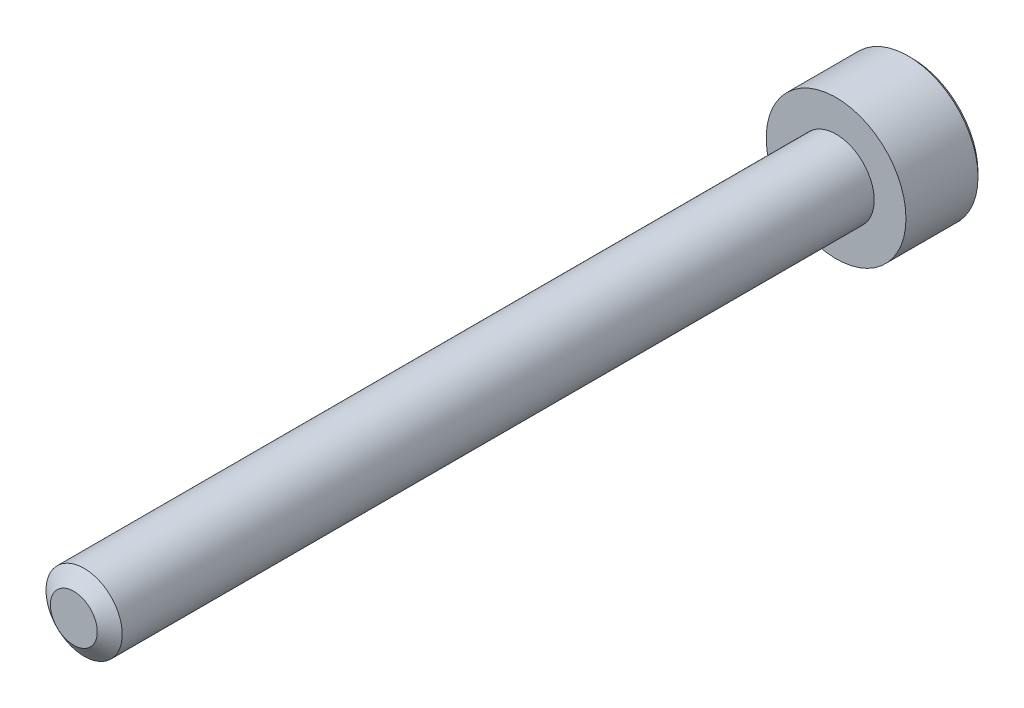
ISO-10303-21;
HEADER;
FILE_DESCRIPTION(('STEP AP214'),'2;1');
FILE_NAME('part.step','',(''),(''),'','','');
FILE_SCHEMA(('AUTOMOTIVE_DESIGN { 1 0 10303 214 1 1 1 1 }'));
ENDSEC;
DATA;
#1=APPLICATION_CONTEXT('core data for automotive mechanical design processes');
#2=APPLICATION_PROTOCOL_DEFINITION('international standard','automotive_design',2000,#1);
#3=PRODUCT_CONTEXT('',#1,'mechanical');
#4=PRODUCT('Part','Part','',(#3));
#5=PRODUCT_RELATED_PRODUCT_CATEGORY('part','',(#4));
#6=PRODUCT_DEFINITION_FORMATION('','',#4);
#7=PRODUCT_DEFINITION_CONTEXT('part definition',#1,'design');
#8=PRODUCT_DEFINITION('design','',#6,#7);
#9=PRODUCT_DEFINITION_SHAPE('','',#8);
#10=(LENGTH_UNIT() NAMED_UNIT(*) SI_UNIT(.MILLI.,.METRE.));
#11=(NAMED_UNIT(*) PLANE_ANGLE_UNIT() SI_UNIT($,.RADIAN.));
#12=(NAMED_UNIT(*) SI_UNIT($,.STERADIAN.) SOLID_ANGLE_UNIT());
#13=UNCERTAINTY_MEASURE_WITH_UNIT(LENGTH_MEASURE(1.E-05),#10,'distance_accuracy_value','');
#14=(GEOMETRIC_REPRESENTATION_CONTEXT(3) GLOBAL_UNCERTAINTY_ASSIGNED_CONTEXT((#13)) GLOBAL_UNIT_ASSIGNED_CONTEXT((#10,
#11,#12)) REPRESENTATION_CONTEXT('',''));
#15=CARTESIAN_POINT('',(0.,0.,0.));
#16=DIRECTION('',(0.,0.,1.));
#17=DIRECTION('',(1.,0.,0.));
#18=AXIS2_PLACEMENT_3D('',#15,#16,#17);
#19=CARTESIAN_POINT('',(0.,-1.44337567297406,-31.125));
#20=DIRECTION('',(-0.5,-0.866025403784439,0.));
#21=DIRECTION('',(0.866025403784439,-0.5,0.));
#22=AXIS2_PLACEMENT_3D('',#19,#20,#21);
#23=PLANE('',#22);
#24=CARTESIAN_POINT('',(-1.24999999999719,-0.721687836488653,-33.0000000000106));
#25=CARTESIAN_POINT('',(-1.20703689149334,-0.746492598748569,-32.9752190397288));
#26=CARTESIAN_POINT('',(-1.16335543595188,-0.771712098864028,-32.9518937494737));
#27=CARTESIAN_POINT('',(-1.07428446543455,-0.823137247669188,-32.9091861389212));
#28=CARTESIAN_POINT('',(-1.02888648443341,-0.849347784220863,-32.8898275733605));
#29=CARTESIAN_POINT('',(-0.937343688520915,-0.902200042083313,-32.8566662159147));
#30=CARTESIAN_POINT('',(-0.891222174140705,-0.928828310826161,-32.8427800967852));
#31=CARTESIAN_POINT('',(-0.79796403889092,-0.982670920316747,-32.8213859018018));
#32=CARTESIAN_POINT('',(-0.750830264933392,-1.00988361739905,-32.8138618619237));
#33=CARTESIAN_POINT('',(-0.669590913521733,-1.05678717880536,-32.8070728277984));
#34=CARTESIAN_POINT('',(-0.635590177984294,-1.07641751262055,-32.8060681886569));
#35=CARTESIAN_POINT('',(-0.567648554675317,-1.11564362712716,-32.8077634952234));
#36=CARTESIAN_POINT('',(-0.533707681782074,-1.13523939922861,-32.8104642592638));
#37=CARTESIAN_POINT('',(-0.466153619735585,-1.174241755136,-32.8194142483472));
#38=CARTESIAN_POINT('',(-0.432540764897262,-1.19364814592514,-32.8256667730595));
#39=CARTESIAN_POINT('',(-0.365876260757552,-1.23213691533559,-32.8413835392478));
#40=CARTESIAN_POINT('',(-0.332824858668373,-1.25121915122888,-32.8508491588607));
#41=CARTESIAN_POINT('',(-0.248213569936039,-1.30006950155497,-32.8789283315822));
#42=CARTESIAN_POINT('',(-0.197186124432403,-1.32953021095255,-32.8996493450655));
#43=CARTESIAN_POINT('',(-0.0971276056231052,-1.38729902372182,-32.9463235058209));
#44=CARTESIAN_POINT('',(-0.0480906425397016,-1.41561052755826,-32.9722596212326));
#45=CARTESIAN_POINT('',(-2.80957824535407E-12,-1.44337567297244,-33.0000000000106));
#46=B_SPLINE_CURVE_WITH_KNOTS('',3,(#24,#25,#26,#27,#28,#29,#30,#31,#32,#33,#34,#35,#36,#37,#38,
#39,#40,#41,#42,#43,#44,#45),.UNSPECIFIED.,.F.,.F.,(4,2,2,2,2,2,2,2,2,2,4),(0.,
0.166478683225078,0.333926926831281,0.498716658516144,0.663091654625516,0.780745575557468,
0.898425484350478,1.01621489976922,1.13405490052337,1.32111591641063,1.50757565757894),.UNSPECIFIED.);
#47=CARTESIAN_POINT('',(-1.25000000000136,-0.721687836486245,-33.0000000000131));
#48=VERTEX_POINT('',#47);
#49=CARTESIAN_POINT('',(-4.16671953249464E-12,-1.44337567297485,-33.0000000000131));
#50=VERTEX_POINT('',#49);
#51=EDGE_CURVE('E21',#48,#50,#46,.T.);
#52=ORIENTED_EDGE('',*,*,#51,.F.);
#53=DIRECTION('',(0.,0.,1.));
#54=VECTOR('',#53,1.);
#55=CARTESIAN_POINT('',(-1.25,-0.721687836487032,-31.125));
#56=LINE('',#55,#54);
#57=CARTESIAN_POINT('',(-1.25,-0.721687836487031,-31.125));
#58=VERTEX_POINT('',#57);
#59=EDGE_CURVE('E104',#48,#58,#56,.T.);
#60=ORIENTED_EDGE('',*,*,#59,.T.);
#61=DIRECTION('',(0.866025403784439,-0.5,0.));
#62=VECTOR('',#61,1.);
#63=CARTESIAN_POINT('',(0.,-1.44337567297406,-31.125));
#64=LINE('',#63,#62);
#65=CARTESIAN_POINT('',(0.,-1.44337567297406,-31.125));
#66=VERTEX_POINT('',#65);
#67=EDGE_CURVE('E77',#66,#58,#64,.F.);
#68=ORIENTED_EDGE('',*,*,#67,.F.);
#69=DIRECTION('',(0.,0.,1.));
#70=VECTOR('',#69,1.);
#71=CARTESIAN_POINT('',(0.,-1.44337567297406,-31.125));
#72=LINE('',#71,#70);
#73=EDGE_CURVE('E76',#66,#50,#72,.F.);
#74=ORIENTED_EDGE('',*,*,#73,.T.);
#75=EDGE_LOOP('',(#52,#60,#68,#74));
#76=FACE_BOUND('',#75,.T.);
#77=ADVANCED_FACE('F17',(#76),#23,.F.);
#78=CARTESIAN_POINT('',(1.25,-0.721687836487033,-31.125));
#79=DIRECTION('',(0.5,-0.866025403784439,0.));
#80=DIRECTION('',(0.866025403784439,0.5,0.));
#81=AXIS2_PLACEMENT_3D('',#78,#79,#80);
#82=PLANE('',#81);
#83=CARTESIAN_POINT('',(2.81411783743714E-12,-1.44337567297244,-33.0000000000106));
#84=CARTESIAN_POINT('',(0.0429631085066566,-1.41857091071252,-32.9752190397288));
#85=CARTESIAN_POINT('',(0.0866445640481205,-1.39335141059707,-32.9518937494737));
#86=CARTESIAN_POINT('',(0.175715534565449,-1.3419262617919,-32.9091861389212));
#87=CARTESIAN_POINT('',(0.221113515566591,-1.31571572524023,-32.8898275733605));
#88=CARTESIAN_POINT('',(0.312656311479088,-1.26286346737778,-32.8566662159147));
#89=CARTESIAN_POINT('',(0.358777825859299,-1.23623519863493,-32.8427800967852));
#90=CARTESIAN_POINT('',(0.452035961109083,-1.18239258914434,-32.8213859018018));
#91=CARTESIAN_POINT('',(0.49916973506661,-1.15517989206204,-32.8138618619237));
#92=CARTESIAN_POINT('',(0.58040908647827,-1.10827633065573,-32.8070728277984));
#93=CARTESIAN_POINT('',(0.614409822015708,-1.08864599684055,-32.8060681886569));
#94=CARTESIAN_POINT('',(0.682351445324686,-1.04941988233393,-32.8077634952234));
#95=CARTESIAN_POINT('',(0.716292318217928,-1.02982411023248,-32.8104642592638));
#96=CARTESIAN_POINT('',(0.783846380264418,-0.99082175432509,-32.8194142483472));
#97=CARTESIAN_POINT('',(0.817459235102742,-0.971415363535952,-32.8256667730595));
#98=CARTESIAN_POINT('',(0.884123739242452,-0.932926594125497,-32.8413835392478));
#99=CARTESIAN_POINT('',(0.91717514133163,-0.913844358232215,-32.8508491588607));
#100=CARTESIAN_POINT('',(1.00178643006396,-0.864994007906121,-32.8789283315822));
#101=CARTESIAN_POINT('',(1.0528138755676,-0.835533298508539,-32.8996493450655));
#102=CARTESIAN_POINT('',(1.15287239437689,-0.777764485739277,-32.9463235058209));
#103=CARTESIAN_POINT('',(1.2019093574603,-0.749452981902834,-32.9722596212326));
#104=CARTESIAN_POINT('',(1.24999999999719,-0.721687836488658,-33.0000000000106));
#105=B_SPLINE_CURVE_WITH_KNOTS('',3,(#83,#84,#85,#86,#87,#88,#89,#90,#91,#92,#93,#94,#95,#96,
#97,#98,#99,#100,#101,#102,#103,#104),.UNSPECIFIED.,.F.,.F.,(4,2,2,2,2,2,2,2,2,2,4),(0.,
0.166478683225079,0.333926926831284,0.498716658516146,0.663091654625518,0.78074557555747,
0.89842548435048,1.01621489976923,1.13405490052337,1.32111591641063,1.50757565757893),.UNSPECIFIED.);
#106=CARTESIAN_POINT('',(1.24999999999859,-0.721687836491034,-33.0000000000131));
#107=VERTEX_POINT('',#106);
#108=EDGE_CURVE('E84',#50,#107,#105,.T.);
#109=ORIENTED_EDGE('',*,*,#108,.F.);
#110=ORIENTED_EDGE('',*,*,#73,.F.);
#111=DIRECTION('',(-0.86602540378444,-0.499999999999997,0.));
#112=VECTOR('',#111,1.);
#113=CARTESIAN_POINT('',(1.25,-0.721687836487033,-31.125));
#114=LINE('',#113,#112);
#115=CARTESIAN_POINT('',(1.25,-0.721687836487033,-31.125));
#116=VERTEX_POINT('',#115);
#117=EDGE_CURVE('E265',#116,#66,#114,.T.);
#118=ORIENTED_EDGE('',*,*,#117,.F.);
#119=DIRECTION('',(0.,0.,-1.));
#120=VECTOR('',#119,1.);
#121=CARTESIAN_POINT('',(1.25,-0.721687836487033,-31.125));
#122=LINE('',#121,#120);
#123=EDGE_CURVE('E103',#116,#107,#122,.T.);
#124=ORIENTED_EDGE('',*,*,#123,.T.);
#125=EDGE_LOOP('',(#109,#110,#118,#124));
#126=FACE_BOUND('',#125,.T.);
#127=ADVANCED_FACE('F101',(#126),#82,.F.);
#128=CARTESIAN_POINT('',(-1.25,-0.721687836487032,-31.125));
#129=DIRECTION('',(-1.,0.,0.));
#130=DIRECTION('',(0.,-1.,0.));
#131=AXIS2_PLACEMENT_3D('',#128,#129,#130);
#132=PLANE('',#131);
#133=CARTESIAN_POINT('',(-1.25,0.721687836483783,-33.0000000000106));
#134=CARTESIAN_POINT('',(-1.25,0.672078311963948,-32.9752190397288));
#135=CARTESIAN_POINT('',(-1.25,0.621639311733029,-32.9518937494737));
#136=CARTESIAN_POINT('',(-1.25,0.518789014122708,-32.9091861389212));
#137=CARTESIAN_POINT('',(-1.25,0.46636794101936,-32.8898275733605));
#138=CARTESIAN_POINT('',(-1.25,0.360663425294459,-32.8566662159147));
#139=CARTESIAN_POINT('',(-1.25,0.307406887808763,-32.8427800967852));
#140=CARTESIAN_POINT('',(-1.25,0.199721668827592,-32.8213859018018));
#141=CARTESIAN_POINT('',(-1.25,0.145296274662989,-32.8138618619237));
#142=CARTESIAN_POINT('',(-1.25,0.0514891518503645,-32.8070728277984));
#143=CARTESIAN_POINT('',(-1.25,0.0122284842199936,-32.8060681886569));
#144=CARTESIAN_POINT('',(-1.25,-0.066223744793243,-32.8077634952234));
#145=CARTESIAN_POINT('',(-1.25,-0.105415288996132,-32.8104642592638));
#146=CARTESIAN_POINT('',(-1.25,-0.183420000810919,-32.8194142483472));
#147=CARTESIAN_POINT('',(-1.25,-0.222232782389194,-32.8256667730595));
#148=CARTESIAN_POINT('',(-1.25,-0.299210321210103,-32.8413835392478));
#149=CARTESIAN_POINT('',(-1.25,-0.337374792996667,-32.8508491588607));
#150=CARTESIAN_POINT('',(-1.25,-0.435075493648855,-32.8789283315822));
#151=CARTESIAN_POINT('',(-1.25,-0.493996912444021,-32.8996493450655));
#152=CARTESIAN_POINT('',(-1.25,-0.609534537982544,-32.9463235058209));
#153=CARTESIAN_POINT('',(-1.25,-0.666157545655431,-32.9722596212326));
#154=CARTESIAN_POINT('',(-1.25,-0.721687836483782,-33.0000000000106));
#155=B_SPLINE_CURVE_WITH_KNOTS('',3,(#133,#134,#135,#136,#137,#138,#139,#140,#141,#142,#143,
#144,#145,#146,#147,#148,#149,#150,#151,#152,#153,#154),.UNSPECIFIED.,.F.,.F.,(4,2,2,2,2,2,2,2,
2,2,4),(0.,0.166478683225082,0.333926926831283,0.498716658516146,0.663091654625519,
0.78074557555747,0.89842548435048,1.01621489976923,1.13405490052337,1.32111591641063,
1.50757565757893),.UNSPECIFIED.);
#156=CARTESIAN_POINT('',(-1.25,0.721687836488597,-33.0000000000131));
#157=VERTEX_POINT('',#156);
#158=EDGE_CURVE('E61',#157,#48,#155,.T.);
#159=ORIENTED_EDGE('',*,*,#158,.F.);
#160=DIRECTION('',(0.,0.,1.));
#161=VECTOR('',#160,1.);
#162=CARTESIAN_POINT('',(-1.25,0.721687836487032,-31.125));
#163=LINE('',#162,#161);
#164=CARTESIAN_POINT('',(-1.25,0.721687836487032,-31.125));
#165=VERTEX_POINT('',#164);
#166=EDGE_CURVE('E242',#157,#165,#163,.T.);
#167=ORIENTED_EDGE('',*,*,#166,.T.);
#168=DIRECTION('',(0.,1.,0.));
#169=VECTOR('',#168,1.);
#170=CARTESIAN_POINT('',(-1.25,2.1650635094611,-31.125));
#171=LINE('',#170,#169);
#172=EDGE_CURVE('E261',#58,#165,#171,.T.);
#173=ORIENTED_EDGE('',*,*,#172,.F.);
#174=ORIENTED_EDGE('',*,*,#59,.F.);
#175=EDGE_LOOP('',(#159,#167,#173,#174));
#176=FACE_BOUND('',#175,.T.);
#177=ADVANCED_FACE('F122',(#176),#132,.F.);
#178=CARTESIAN_POINT('',(1.25,2.1650635094611,-31.125));
#179=DIRECTION('',(0.,0.,-1.));
#180=DIRECTION('',(-1.,0.,0.));
#181=AXIS2_PLACEMENT_3D('',#178,#179,#180);
#182=PLANE('',#181);
#183=ORIENTED_EDGE('',*,*,#67,.T.);
#184=ORIENTED_EDGE('',*,*,#172,.T.);
#185=DIRECTION('',(-0.866025403784439,-0.5,0.));
#186=VECTOR('',#185,1.);
#187=CARTESIAN_POINT('',(-1.25,0.721687836487032,-31.125));
#188=LINE('',#187,#186);
#189=CARTESIAN_POINT('',(0.,1.44337567297406,-31.125));
#190=VERTEX_POINT('',#189);
#191=EDGE_CURVE('E144',#165,#190,#188,.F.);
#192=ORIENTED_EDGE('',*,*,#191,.T.);
#193=DIRECTION('',(-0.866025403784439,0.5,0.));
#194=VECTOR('',#193,1.);
#195=CARTESIAN_POINT('',(0.,1.44337567297406,-31.125));
#196=LINE('',#195,#194);
#197=CARTESIAN_POINT('',(1.25,0.721687836487029,-31.125));
#198=VERTEX_POINT('',#197);
#199=EDGE_CURVE('E239',#190,#198,#196,.F.);
#200=ORIENTED_EDGE('',*,*,#199,.T.);
#201=DIRECTION('',(0.,1.,0.));
#202=VECTOR('',#201,1.);
#203=CARTESIAN_POINT('',(1.25,0.721687836487032,-31.125));
#204=LINE('',#203,#202);
#205=EDGE_CURVE('E256',#198,#116,#204,.F.);
#206=ORIENTED_EDGE('',*,*,#205,.T.);
#207=ORIENTED_EDGE('',*,*,#117,.T.);
#208=EDGE_LOOP('',(#183,#184,#192,#200,#206,#207));
#209=FACE_BOUND('',#208,.T.);
#210=ADVANCED_FACE('F126',(#209),#182,.T.);
#211=CARTESIAN_POINT('',(1.25,0.721687836487032,-31.125));
#212=DIRECTION('',(1.,0.,0.));
#213=DIRECTION('',(0.,0.,-1.));
#214=AXIS2_PLACEMENT_3D('',#211,#212,#213);
#215=PLANE('',#214);
#216=CARTESIAN_POINT('',(1.25,-0.721687836483783,-33.0000000000106));
#217=CARTESIAN_POINT('',(1.25,-0.672078311963948,-32.9752190397288));
#218=CARTESIAN_POINT('',(1.25,-0.621639311733029,-32.9518937494737));
#219=CARTESIAN_POINT('',(1.25,-0.518789014122707,-32.9091861389212));
#220=CARTESIAN_POINT('',(1.25,-0.466367941019357,-32.8898275733605));
#221=CARTESIAN_POINT('',(1.25,-0.360663425294455,-32.8566662159147));
#222=CARTESIAN_POINT('',(1.25,-0.307406887808759,-32.8427800967852));
#223=CARTESIAN_POINT('',(1.25,-0.199721668827589,-32.8213859018018));
#224=CARTESIAN_POINT('',(1.25,-0.145296274662988,-32.8138618619237));
#225=CARTESIAN_POINT('',(1.25,-0.0514891518503652,-32.8070728277984));
#226=CARTESIAN_POINT('',(1.25,-0.0122284842199946,-32.8060681886569));
#227=CARTESIAN_POINT('',(1.25,0.0662237447932413,-32.8077634952234));
#228=CARTESIAN_POINT('',(1.25,0.10541528899613,-32.8104642592638));
#229=CARTESIAN_POINT('',(1.25,0.183420000810917,-32.8194142483472));
#230=CARTESIAN_POINT('',(1.25,0.222232782389193,-32.8256667730595));
#231=CARTESIAN_POINT('',(1.25,0.299210321210102,-32.8413835392478));
#232=CARTESIAN_POINT('',(1.25,0.337374792996666,-32.8508491588607));
#233=CARTESIAN_POINT('',(1.25,0.435075493649003,-32.8789283315822));
#234=CARTESIAN_POINT('',(1.25,0.493996912444312,-32.8996493450656));
#235=CARTESIAN_POINT('',(1.25,0.609534537983112,-32.9463235058211));
#236=CARTESIAN_POINT('',(1.25,0.666157545656132,-32.9722596212329));
#237=CARTESIAN_POINT('',(1.25,0.721687836484612,-33.0000000000111));
#238=B_SPLINE_CURVE_WITH_KNOTS('',3,(#216,#217,#218,#219,#220,#221,#222,#223,#224,#225,#226,
#227,#228,#229,#230,#231,#232,#233,#234,#235,#236,#237),.UNSPECIFIED.,.F.,.F.,(4,2,2,2,2,2,2,2,
2,2,4),(0.,0.166478683225082,0.333926926831288,0.498716658516149,0.663091654625518,
0.780745575557469,0.898425484350478,1.01621489976923,1.13405490052337,1.32111591641109,
1.50757565757986),.UNSPECIFIED.);
#239=CARTESIAN_POINT('',(1.25000000000033,0.721687836488433,-33.0000000000133));
#240=VERTEX_POINT('',#239);
#241=EDGE_CURVE('E40',#107,#240,#238,.T.);
#242=ORIENTED_EDGE('',*,*,#241,.F.);
#243=ORIENTED_EDGE('',*,*,#123,.F.);
#244=ORIENTED_EDGE('',*,*,#205,.F.);
#245=DIRECTION('',(0.,0.,1.));
#246=VECTOR('',#245,1.);
#247=CARTESIAN_POINT('',(1.25,0.721687836487029,-31.125));
#248=LINE('',#247,#246);
#249=EDGE_CURVE('E235',#198,#240,#248,.F.);
#250=ORIENTED_EDGE('',*,*,#249,.T.);
#251=EDGE_LOOP('',(#242,#243,#244,#250));
#252=FACE_BOUND('',#251,.T.);
#253=ADVANCED_FACE('F130',(#252),#215,.F.);
#254=CARTESIAN_POINT('',(-1.25,0.721687836487032,-31.125));
#255=DIRECTION('',(-0.5,0.866025403784439,0.));
#256=DIRECTION('',(-0.866025403784439,-0.5,0.));
#257=AXIS2_PLACEMENT_3D('',#254,#255,#256);
#258=PLANE('',#257);
#259=CARTESIAN_POINT('',(-2.09632003303961E-12,1.44337567297285,-33.0000000000111));
#260=CARTESIAN_POINT('',(-0.0429631085059828,1.41857091071291,-32.9752190397292));
#261=CARTESIAN_POINT('',(-0.0866445640474911,1.39335141059743,-32.9518937494741));
#262=CARTESIAN_POINT('',(-0.175715534564911,1.34192626179221,-32.9091861389215));
#263=CARTESIAN_POINT('',(-0.221113515566101,1.31571572524051,-32.8898275733607));
#264=CARTESIAN_POINT('',(-0.312656311478696,1.262863467378,-32.8566662159148));
#265=CARTESIAN_POINT('',(-0.358777825858958,1.23623519863513,-32.8427800967853));
#266=CARTESIAN_POINT('',(-0.452035961108846,1.18239258914448,-32.8213859018019));
#267=CARTESIAN_POINT('',(-0.499169735066427,1.15517989206215,-32.8138618619237));
#268=CARTESIAN_POINT('',(-0.580409086478143,1.1082763306558,-32.8070728277984));
#269=CARTESIAN_POINT('',(-0.614409822015584,1.08864599684062,-32.8060681886569));
#270=CARTESIAN_POINT('',(-0.682351445324567,1.049419882334,-32.8077634952234));
#271=CARTESIAN_POINT('',(-0.716292318217812,1.02982411023255,-32.8104642592638));
#272=CARTESIAN_POINT('',(-0.783846380264307,0.990821754325153,-32.8194142483471));
#273=CARTESIAN_POINT('',(-0.817459235102632,0.971415363536014,-32.8256667730595));
#274=CARTESIAN_POINT('',(-0.884123739242347,0.932926594125557,-32.8413835392478));
#275=CARTESIAN_POINT('',(-0.91717514133153,0.913844358232273,-32.8508491588607));
#276=CARTESIAN_POINT('',(-1.00178643006388,0.864994007906168,-32.8789283315821));
#277=CARTESIAN_POINT('',(-1.05281387556753,0.835533298508576,-32.8996493450654));
#278=CARTESIAN_POINT('',(-1.15287239437686,0.777764485739296,-32.9463235058209));
#279=CARTESIAN_POINT('',(-1.20190935746028,0.749452981902842,-32.9722596212326));
#280=CARTESIAN_POINT('',(-1.24999999999719,0.721687836488657,-33.0000000000106));
#281=B_SPLINE_CURVE_WITH_KNOTS('',3,(#259,#260,#261,#262,#263,#264,#265,#266,#267,#268,#269,
#270,#271,#272,#273,#274,#275,#276,#277,#278,#279,#280),.UNSPECIFIED.,.F.,.F.,(4,2,2,2,2,2,2,2,
2,2,4),(0.,0.166478683225274,0.333926926831679,0.498716658516734,0.663091654626296,
0.780745575558257,0.898425484351275,1.01621489977003,1.13405490052418,1.32111591641149,
1.50757565757986),.UNSPECIFIED.);
#282=CARTESIAN_POINT('',(-1.71900959987395E-12,1.44337567297505,-33.0000000000133));
#283=VERTEX_POINT('',#282);
#284=EDGE_CURVE('E145',#283,#157,#281,.T.);
#285=ORIENTED_EDGE('',*,*,#284,.F.);
#286=DIRECTION('',(0.,0.,1.));
#287=VECTOR('',#286,1.);
#288=CARTESIAN_POINT('',(0.,1.44337567297406,-31.125));
#289=LINE('',#288,#287);
#290=EDGE_CURVE('E170',#283,#190,#289,.T.);
#291=ORIENTED_EDGE('',*,*,#290,.T.);
#292=ORIENTED_EDGE('',*,*,#191,.F.);
#293=ORIENTED_EDGE('',*,*,#166,.F.);
#294=EDGE_LOOP('',(#285,#291,#292,#293));
#295=FACE_BOUND('',#294,.T.);
#296=ADVANCED_FACE('F135',(#295),#258,.F.);
#297=CARTESIAN_POINT('',(0.,1.44337567297406,-31.125));
#298=DIRECTION('',(0.5,0.866025403784439,0.));
#299=DIRECTION('',(-0.866025403784439,0.5,0.));
#300=AXIS2_PLACEMENT_3D('',#297,#298,#299);
#301=PLANE('',#300);
#302=CARTESIAN_POINT('',(2.09347186406145E-12,1.44337567297285,-33.0000000000111));
#303=CARTESIAN_POINT('',(0.042963108505979,1.41857091071291,-32.9752190397292));
#304=CARTESIAN_POINT('',(0.0866445640474883,1.39335141059743,-32.951893749474));
#305=CARTESIAN_POINT('',(0.175715534564911,1.34192626179221,-32.9091861389215));
#306=CARTESIAN_POINT('',(0.221113515566101,1.31571572524051,-32.8898275733607));
#307=CARTESIAN_POINT('',(0.312656311478697,1.262863467378,-32.8566662159148));
#308=CARTESIAN_POINT('',(0.358777825858957,1.23623519863512,-32.8427800967853));
#309=CARTESIAN_POINT('',(0.452035961108844,1.18239258914448,-32.8213859018019));
#310=CARTESIAN_POINT('',(0.499169735066425,1.15517989206215,-32.8138618619237));
#311=CARTESIAN_POINT('',(0.58040908647814,1.1082763306558,-32.8070728277984));
#312=CARTESIAN_POINT('',(0.614409822015581,1.08864599684061,-32.8060681886569));
#313=CARTESIAN_POINT('',(0.682351445324563,1.04941988233399,-32.8077634952234));
#314=CARTESIAN_POINT('',(0.716292318217808,1.02982411023255,-32.8104642592638));
#315=CARTESIAN_POINT('',(0.783846380264303,0.990821754325151,-32.8194142483471));
#316=CARTESIAN_POINT('',(0.81745923510263,0.971415363536012,-32.8256667730595));
#317=CARTESIAN_POINT('',(0.884123739242345,0.932926594125554,-32.8413835392478));
#318=CARTESIAN_POINT('',(0.917175141331527,0.91384435823227,-32.8508491588607));
#319=CARTESIAN_POINT('',(1.00178643006401,0.864994007906091,-32.8789283315822));
#320=CARTESIAN_POINT('',(1.05281387556778,0.835533298508428,-32.8996493450656));
#321=CARTESIAN_POINT('',(1.15287239437735,0.777764485739009,-32.9463235058211));
#322=CARTESIAN_POINT('',(1.20190935746088,0.749452981902489,-32.9722596212329));
#323=CARTESIAN_POINT('',(1.2499999999979,0.72168783648824,-33.0000000000111));
#324=B_SPLINE_CURVE_WITH_KNOTS('',3,(#302,#303,#304,#305,#306,#307,#308,#309,#310,#311,#312,
#313,#314,#315,#316,#317,#318,#319,#320,#321,#322,#323),.UNSPECIFIED.,.F.,.F.,(4,2,2,2,2,2,2,2,
2,2,4),(0.,0.166478683225279,0.333926926831683,0.498716658516736,0.663091654626297,
0.780745575558257,0.898425484351274,1.01621489977003,1.13405490052418,1.32111591641196,
1.50757565758079),.UNSPECIFIED.);
#325=EDGE_CURVE('E162',#283,#240,#324,.T.);
#326=ORIENTED_EDGE('',*,*,#325,.T.);
#327=ORIENTED_EDGE('',*,*,#249,.F.);
#328=ORIENTED_EDGE('',*,*,#199,.F.);
#329=ORIENTED_EDGE('',*,*,#290,.F.);
#330=EDGE_LOOP('',(#326,#327,#328,#329));
#331=FACE_BOUND('',#330,.T.);
#332=ADVANCED_FACE('F172',(#331),#301,.F.);
#333=CARTESIAN_POINT('',(0.,0.,-32.9999999999586));
#334=DIRECTION('',(0.,0.,-1.));
#335=DIRECTION('',(-1.,0.,0.));
#336=AXIS2_PLACEMENT_3D('',#333,#334,#335);
#337=CONICAL_SURFACE('',#336,1.44337567292041,0.785398163397448);
#338=ORIENTED_EDGE('',*,*,#284,.T.);
#339=CARTESIAN_POINT('',(0.,0.,-33.0000000000155));
#340=DIRECTION('',(0.,0.,-1.));
#341=DIRECTION('',(-1.,0.,0.));
#342=AXIS2_PLACEMENT_3D('',#339,#340,#341);
#343=CIRCLE('',#342,1.44337567297725);
#344=EDGE_CURVE('E169',#283,#157,#343,.F.);
#345=ORIENTED_EDGE('',*,*,#344,.F.);
#346=EDGE_LOOP('',(#338,#345));
#347=FACE_BOUND('',#346,.T.);
#348=ADVANCED_FACE('F175',(#347),#337,.F.);
#349=CARTESIAN_POINT('',(0.,0.,-32.9999999999586));
#350=DIRECTION('',(0.,0.,-1.));
#351=DIRECTION('',(-1.,0.,0.));
#352=AXIS2_PLACEMENT_3D('',#349,#350,#351);
#353=CONICAL_SURFACE('',#352,1.44337567292041,0.785398163397448);
#354=CARTESIAN_POINT('',(0.,0.,-33.0000000000155));
#355=DIRECTION('',(0.,0.,-1.));
#356=DIRECTION('',(-1.,0.,0.));
#357=AXIS2_PLACEMENT_3D('',#354,#355,#356);
#358=CIRCLE('',#357,1.44337567297725);
#359=EDGE_CURVE('E94',#157,#48,#358,.F.);
#360=ORIENTED_EDGE('',*,*,#359,.F.);
#361=ORIENTED_EDGE('',*,*,#158,.T.);
#362=EDGE_LOOP('',(#360,#361));
#363=FACE_BOUND('',#362,.T.);
#364=ADVANCED_FACE('F179',(#363),#353,.F.);
#365=CARTESIAN_POINT('',(0.,0.,-32.9999999999586));
#366=DIRECTION('',(0.,0.,-1.));
#367=DIRECTION('',(-1.,0.,0.));
#368=AXIS2_PLACEMENT_3D('',#365,#366,#367);
#369=CONICAL_SURFACE('',#368,1.44337567292041,0.785398163397448);
#370=ORIENTED_EDGE('',*,*,#51,.T.);
#371=CARTESIAN_POINT('',(0.,0.,-33.0000000000155));
#372=DIRECTION('',(0.,0.,-1.));
#373=DIRECTION('',(-1.,0.,0.));
#374=AXIS2_PLACEMENT_3D('',#371,#372,#373);
#375=CIRCLE('',#374,1.44337567297725);
#376=EDGE_CURVE('E72',#48,#50,#375,.F.);
#377=ORIENTED_EDGE('',*,*,#376,.F.);
#378=EDGE_LOOP('',(#370,#377));
#379=FACE_BOUND('',#378,.T.);
#380=ADVANCED_FACE('F70',(#379),#369,.F.);
#381=CARTESIAN_POINT('',(0.,0.,-32.9999999999586));
#382=DIRECTION('',(0.,0.,-1.));
#383=DIRECTION('',(-1.,0.,0.));
#384=AXIS2_PLACEMENT_3D('',#381,#382,#383);
#385=CONICAL_SURFACE('',#384,1.44337567292041,0.785398163397448);
#386=ORIENTED_EDGE('',*,*,#108,.T.);
#387=CARTESIAN_POINT('',(0.,0.,-33.0000000000155));
#388=DIRECTION('',(0.,0.,-1.));
#389=DIRECTION('',(-1.,0.,0.));
#390=AXIS2_PLACEMENT_3D('',#387,#388,#389);
#391=CIRCLE('',#390,1.44337567297725);
#392=EDGE_CURVE('E92',#50,#107,#391,.F.);
#393=ORIENTED_EDGE('',*,*,#392,.F.);
#394=EDGE_LOOP('',(#386,#393));
#395=FACE_BOUND('',#394,.T.);
#396=ADVANCED_FACE('F97',(#395),#385,.F.);
#397=CARTESIAN_POINT('',(0.,0.,-32.9999999999586));
#398=DIRECTION('',(0.,0.,-1.));
#399=DIRECTION('',(-1.,0.,0.));
#400=AXIS2_PLACEMENT_3D('',#397,#398,#399);
#401=CONICAL_SURFACE('',#400,1.44337567292041,0.785398163397448);
#402=ORIENTED_EDGE('',*,*,#241,.T.);
#403=CARTESIAN_POINT('',(0.,0.,-33.0000000000155));
#404=DIRECTION('',(0.,0.,-1.));
#405=DIRECTION('',(-1.,0.,0.));
#406=AXIS2_PLACEMENT_3D('',#403,#404,#405);
#407=CIRCLE('',#406,1.44337567297725);
#408=EDGE_CURVE('E99',#107,#240,#407,.F.);
#409=ORIENTED_EDGE('',*,*,#408,.F.);
#410=EDGE_LOOP('',(#402,#409));
#411=FACE_BOUND('',#410,.T.);
#412=ADVANCED_FACE('F152',(#411),#401,.F.);
#413=CARTESIAN_POINT('',(0.,0.,-32.9999999999586));
#414=DIRECTION('',(0.,0.,-1.));
#415=DIRECTION('',(-1.,0.,0.));
#416=AXIS2_PLACEMENT_3D('',#413,#414,#415);
#417=CONICAL_SURFACE('',#416,1.44337567292041,0.785398163397448);
#418=ORIENTED_EDGE('',*,*,#325,.F.);
#419=CARTESIAN_POINT('',(0.,0.,-33.0000000000155));
#420=DIRECTION('',(0.,0.,-1.));
#421=DIRECTION('',(-1.,0.,0.));
#422=AXIS2_PLACEMENT_3D('',#419,#420,#421);
#423=CIRCLE('',#422,1.44337567297725);
#424=EDGE_CURVE('E230',#240,#283,#423,.F.);
#425=ORIENTED_EDGE('',*,*,#424,.F.);
#426=EDGE_LOOP('',(#418,#425));
#427=FACE_BOUND('',#426,.T.);
#428=ADVANCED_FACE('F156',(#427),#417,.F.);
#429=CARTESIAN_POINT('',(0.,0.,-33.));
#430=DIRECTION('',(0.,0.,-1.));
#431=DIRECTION('',(-1.,0.,0.));
#432=AXIS2_PLACEMENT_3D('',#429,#430,#431);
#433=PLANE('',#432);
#434=ORIENTED_EDGE('',*,*,#408,.T.);
#435=ORIENTED_EDGE('',*,*,#424,.T.);
#436=ORIENTED_EDGE('',*,*,#344,.T.);
#437=ORIENTED_EDGE('',*,*,#359,.T.);
#438=ORIENTED_EDGE('',*,*,#376,.T.);
#439=ORIENTED_EDGE('',*,*,#392,.T.);
#440=EDGE_LOOP('',(#434,#435,#436,#437,#438,#439));
#441=FACE_BOUND('',#440,.T.);
#442=CARTESIAN_POINT('',(0.,0.,-33.0000000000723));
#443=DIRECTION('',(0.,0.,1.));
#444=DIRECTION('',(1.,0.,0.));
#445=AXIS2_PLACEMENT_3D('',#442,#443,#444);
#446=CIRCLE('',#445,2.5850000000105);
#447=CARTESIAN_POINT('',(2.5850000000105,0.,-33.0000000000723));
#448=VERTEX_POINT('',#447);
#449=EDGE_CURVE('E221',#448,#448,#446,.T.);
#450=ORIENTED_EDGE('',*,*,#449,.F.);
#451=EDGE_LOOP('',(#450));
#452=FACE_BOUND('',#451,.T.);
#453=ADVANCED_FACE('F90',(#441,#452),#433,.T.);
#454=CARTESIAN_POINT('',(0.,0.,-32.8350000000341));
#455=DIRECTION('',(0.,0.,1.));
#456=DIRECTION('',(1.,0.,0.));
#457=AXIS2_PLACEMENT_3D('',#454,#455,#456);
#458=CONICAL_SURFACE('',#457,2.7500000001055,0.785398163569701);
#459=ORIENTED_EDGE('',*,*,#449,.T.);
#460=EDGE_LOOP('',(#459));
#461=FACE_BOUND('',#460,.T.);
#462=CARTESIAN_POINT('',(0.,0.,-32.835));
#463=DIRECTION('',(0.,0.,1.));
#464=DIRECTION('',(1.,0.,0.));
#465=AXIS2_PLACEMENT_3D('',#462,#463,#464);
#466=CIRCLE('',#465,2.75);
#467=CARTESIAN_POINT('',(2.75,0.,-32.835));
#468=VERTEX_POINT('',#467);
#469=EDGE_CURVE('E224',#468,#468,#466,.T.);
#470=ORIENTED_EDGE('',*,*,#469,.F.);
#471=EDGE_LOOP('',(#470));
#472=FACE_BOUND('',#471,.T.);
#473=ADVANCED_FACE('F211',(#461,#472),#458,.T.);
#474=CARTESIAN_POINT('',(0.,0.,-33.));
#475=DIRECTION('',(0.,0.,1.));
#476=DIRECTION('',(1.,0.,0.));
#477=AXIS2_PLACEMENT_3D('',#474,#475,#476);
#478=CYLINDRICAL_SURFACE('',#477,2.75);
#479=ORIENTED_EDGE('',*,*,#469,.T.);
#480=EDGE_LOOP('',(#479));
#481=FACE_BOUND('',#480,.T.);
#482=CARTESIAN_POINT('',(0.,0.,-30.));
#483=DIRECTION('',(0.,0.,1.));
#484=DIRECTION('',(1.,0.,0.));
#485=AXIS2_PLACEMENT_3D('',#482,#483,#484);
#486=CIRCLE('',#485,2.75);
#487=CARTESIAN_POINT('',(2.75,0.,-30.));
#488=VERTEX_POINT('',#487);
#489=EDGE_CURVE('E225',#488,#488,#486,.F.);
#490=ORIENTED_EDGE('',*,*,#489,.T.);
#491=EDGE_LOOP('',(#490));
#492=FACE_BOUND('',#491,.T.);
#493=ADVANCED_FACE('F208',(#481,#492),#478,.T.);
#494=CARTESIAN_POINT('',(0.,0.,0.));
#495=DIRECTION('',(0.,0.,1.));
#496=DIRECTION('',(1.,0.,0.));
#497=AXIS2_PLACEMENT_3D('',#494,#495,#496);
#498=PLANE('',#497);
#499=CARTESIAN_POINT('',(0.,0.,5.6843418860808E-11));
#500=DIRECTION('',(0.,0.,-1.));
#501=DIRECTION('',(-1.,0.,0.));
#502=AXIS2_PLACEMENT_3D('',#499,#500,#501);
#503=CIRCLE('',#502,0.921240473587659);
#504=CARTESIAN_POINT('',(-0.921240473587659,0.,5.6843418860808E-11));
#505=VERTEX_POINT('',#504);
#506=EDGE_CURVE('E228',#505,#505,#503,.T.);
#507=ORIENTED_EDGE('',*,*,#506,.F.);
#508=EDGE_LOOP('',(#507));
#509=FACE_BOUND('',#508,.T.);
#510=ADVANCED_FACE('F204',(#509),#498,.T.);
#511=CARTESIAN_POINT('',(0.,0.,-30.));
#512=DIRECTION('',(0.,0.,-1.));
#513=DIRECTION('',(-1.,0.,0.));
#514=AXIS2_PLACEMENT_3D('',#511,#512,#513);
#515=PLANE('',#514);
#516=CARTESIAN_POINT('',(0.,0.,-30.));
#517=DIRECTION('',(0.,0.,-1.));
#518=DIRECTION('',(-1.,0.,0.));
#519=AXIS2_PLACEMENT_3D('',#516,#517,#518);
#520=CIRCLE('',#519,1.5);
#521=CARTESIAN_POINT('',(-1.5,0.,-30.));
#522=VERTEX_POINT('',#521);
#523=EDGE_CURVE('E32',#522,#522,#520,.F.);
#524=ORIENTED_EDGE('',*,*,#523,.F.);
#525=EDGE_LOOP('',(#524));
#526=FACE_BOUND('',#525,.T.);
#527=ORIENTED_EDGE('',*,*,#489,.F.);
#528=EDGE_LOOP('',(#527));
#529=FACE_BOUND('',#528,.T.);
#530=ADVANCED_FACE('F197',(#526,#529),#515,.F.);
#531=CARTESIAN_POINT('',(0.,0.,-0.405251783149652));
#532=DIRECTION('',(0.,0.,-1.));
#533=DIRECTION('',(-1.,0.,0.));
#534=AXIS2_PLACEMENT_3D('',#531,#532,#533);
#535=CONICAL_SURFACE('',#534,1.50000000002137,0.959931088612039);
#536=ORIENTED_EDGE('',*,*,#506,.T.);
#537=EDGE_LOOP('',(#536));
#538=FACE_BOUND('',#537,.T.);
#539=CARTESIAN_POINT('',(0.,0.,-0.405251783209379));
#540=DIRECTION('',(0.,0.,-1.));
#541=DIRECTION('',(-1.,0.,0.));
#542=AXIS2_PLACEMENT_3D('',#539,#540,#541);
#543=CIRCLE('',#542,1.5);
#544=CARTESIAN_POINT('',(-1.5,0.,-0.405251783209379));
#545=VERTEX_POINT('',#544);
#546=EDGE_CURVE('E11',#545,#545,#543,.T.);
#547=ORIENTED_EDGE('',*,*,#546,.F.);
#548=EDGE_LOOP('',(#547));
#549=FACE_BOUND('',#548,.T.);
#550=ADVANCED_FACE('F191',(#538,#549),#535,.T.);
#551=CARTESIAN_POINT('',(0.,0.,0.));
#552=DIRECTION('',(0.,0.,-1.));
#553=DIRECTION('',(-1.,0.,0.));
#554=AXIS2_PLACEMENT_3D('',#551,#552,#553);
#555=CYLINDRICAL_SURFACE('',#554,1.5);
#556=ORIENTED_EDGE('',*,*,#546,.T.);
#557=EDGE_LOOP('',(#556));
#558=FACE_BOUND('',#557,.T.);
#559=ORIENTED_EDGE('',*,*,#523,.T.);
#560=EDGE_LOOP('',(#559));
#561=FACE_BOUND('',#560,.T.);
#562=ADVANCED_FACE('F189',(#558,#561),#555,.T.);
#563=CLOSED_SHELL('',(#77,#127,#177,#210,#253,#296,#332,#348,#364,#380,#396,#412,#428,#453,#473,
#493,#510,#530,#550,#562));
#564=MANIFOLD_SOLID_BREP('B1',#563);
#565=ADVANCED_BREP_SHAPE_REPRESENTATION('',(#18,#564),#14);
#566=SHAPE_DEFINITION_REPRESENTATION(#9,#565);
ENDSEC;
END-ISO-10303-21;
